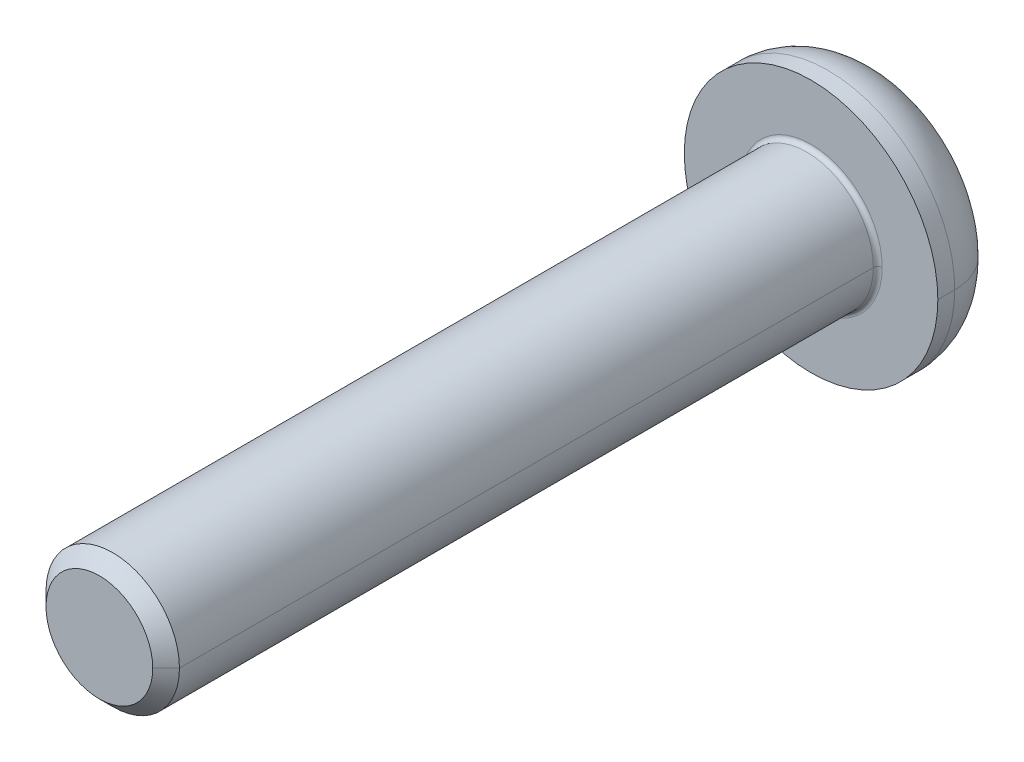
ISO-10303-21;
HEADER;
FILE_DESCRIPTION(('STEP AP214'),'2;1');
FILE_NAME('part.step','',(''),(''),'','','');
FILE_SCHEMA(('AUTOMOTIVE_DESIGN { 1 0 10303 214 1 1 1 1 }'));
ENDSEC;
DATA;
#1=APPLICATION_CONTEXT('core data for automotive mechanical design processes');
#2=APPLICATION_PROTOCOL_DEFINITION('international standard','automotive_design',2000,#1);
#3=PRODUCT_CONTEXT('',#1,'mechanical');
#4=PRODUCT('Part','Part','',(#3));
#5=PRODUCT_RELATED_PRODUCT_CATEGORY('part','',(#4));
#6=PRODUCT_DEFINITION_FORMATION('','',#4);
#7=PRODUCT_DEFINITION_CONTEXT('part definition',#1,'design');
#8=PRODUCT_DEFINITION('design','',#6,#7);
#9=PRODUCT_DEFINITION_SHAPE('','',#8);
#10=(LENGTH_UNIT() NAMED_UNIT(*) SI_UNIT(.MILLI.,.METRE.));
#11=(NAMED_UNIT(*) PLANE_ANGLE_UNIT() SI_UNIT($,.RADIAN.));
#12=(NAMED_UNIT(*) SI_UNIT($,.STERADIAN.) SOLID_ANGLE_UNIT());
#13=UNCERTAINTY_MEASURE_WITH_UNIT(LENGTH_MEASURE(1.E-05),#10,'distance_accuracy_value','');
#14=(GEOMETRIC_REPRESENTATION_CONTEXT(3) GLOBAL_UNCERTAINTY_ASSIGNED_CONTEXT((#13)) GLOBAL_UNIT_ASSIGNED_CONTEXT((#10,
#11,#12)) REPRESENTATION_CONTEXT('',''));
#15=CARTESIAN_POINT('',(0.,0.,0.));
#16=DIRECTION('',(0.,0.,1.));
#17=DIRECTION('',(1.,0.,0.));
#18=AXIS2_PLACEMENT_3D('',#15,#16,#17);
#19=CARTESIAN_POINT('',(0.,0.,0.1));
#20=DIRECTION('',(0.,0.,-1.));
#21=DIRECTION('',(-1.,0.,0.));
#22=AXIS2_PLACEMENT_3D('',#19,#20,#21);
#23=TOROIDAL_SURFACE('',#22,1.6,0.1);
#24=CARTESIAN_POINT('',(1.6,0.,0.1));
#25=DIRECTION('',(0.,1.,0.));
#26=DIRECTION('',(-1.,0.,0.));
#27=AXIS2_PLACEMENT_3D('',#24,#25,#26);
#28=CIRCLE('',#27,0.1);
#29=CARTESIAN_POINT('',(1.6,0.,0.));
#30=VERTEX_POINT('',#29);
#31=CARTESIAN_POINT('',(1.5,0.,0.1));
#32=VERTEX_POINT('',#31);
#33=EDGE_CURVE('E301',#30,#32,#28,.T.);
#34=ORIENTED_EDGE('',*,*,#33,.F.);
#35=CARTESIAN_POINT('',(0.,0.,0.));
#36=DIRECTION('',(0.,0.,-1.));
#37=DIRECTION('',(-1.,0.,0.));
#38=AXIS2_PLACEMENT_3D('',#35,#36,#37);
#39=CIRCLE('',#38,1.6);
#40=CARTESIAN_POINT('',(-1.6,0.,0.));
#41=VERTEX_POINT('',#40);
#42=EDGE_CURVE('E167',#41,#30,#39,.T.);
#43=ORIENTED_EDGE('',*,*,#42,.F.);
#44=CARTESIAN_POINT('',(-1.6,0.,0.1));
#45=DIRECTION('',(0.,-1.,0.));
#46=DIRECTION('',(0.,0.,-1.));
#47=AXIS2_PLACEMENT_3D('',#44,#45,#46);
#48=CIRCLE('',#47,0.1);
#49=CARTESIAN_POINT('',(-1.5,0.,0.1));
#50=VERTEX_POINT('',#49);
#51=EDGE_CURVE('E173',#41,#50,#48,.T.);
#52=ORIENTED_EDGE('',*,*,#51,.T.);
#53=CARTESIAN_POINT('',(0.,0.,0.1));
#54=DIRECTION('',(0.,0.,1.));
#55=DIRECTION('',(-1.,0.,0.));
#56=AXIS2_PLACEMENT_3D('',#53,#54,#55);
#57=CIRCLE('',#56,1.5);
#58=EDGE_CURVE('E221',#32,#50,#57,.T.);
#59=ORIENTED_EDGE('',*,*,#58,.F.);
#60=EDGE_LOOP('',(#34,#43,#52,#59));
#61=FACE_BOUND('',#60,.T.);
#62=ADVANCED_FACE('F17',(#61),#23,.F.);
#63=CARTESIAN_POINT('',(0.,0.,-0.38));
#64=DIRECTION('',(0.,0.,-1.));
#65=DIRECTION('',(-1.,0.,0.));
#66=AXIS2_PLACEMENT_3D('',#63,#64,#65);
#67=TOROIDAL_SURFACE('',#66,1.58,1.27);
#68=CARTESIAN_POINT('',(1.58,0.,-0.38));
#69=DIRECTION('',(0.,1.,0.));
#70=DIRECTION('',(-1.,0.,0.));
#71=AXIS2_PLACEMENT_3D('',#68,#69,#70);
#72=CIRCLE('',#71,1.27);
#73=CARTESIAN_POINT('',(2.85,0.,-0.38));
#74=VERTEX_POINT('',#73);
#75=CARTESIAN_POINT('',(1.58,0.,-1.65));
#76=VERTEX_POINT('',#75);
#77=EDGE_CURVE('E188',#74,#76,#72,.T.);
#78=ORIENTED_EDGE('',*,*,#77,.F.);
#79=CARTESIAN_POINT('',(0.,0.,-0.38));
#80=DIRECTION('',(0.,0.,1.));
#81=DIRECTION('',(-1.,0.,0.));
#82=AXIS2_PLACEMENT_3D('',#79,#80,#81);
#83=CIRCLE('',#82,2.85);
#84=CARTESIAN_POINT('',(-2.85,0.,-0.38));
#85=VERTEX_POINT('',#84);
#86=EDGE_CURVE('E203',#85,#74,#83,.T.);
#87=ORIENTED_EDGE('',*,*,#86,.F.);
#88=CARTESIAN_POINT('',(-1.58,0.,-0.38));
#89=DIRECTION('',(0.,-1.,0.));
#90=DIRECTION('',(0.,0.,-1.));
#91=AXIS2_PLACEMENT_3D('',#88,#89,#90);
#92=CIRCLE('',#91,1.27);
#93=CARTESIAN_POINT('',(-1.58,0.,-1.65));
#94=VERTEX_POINT('',#93);
#95=EDGE_CURVE('E198',#85,#94,#92,.T.);
#96=ORIENTED_EDGE('',*,*,#95,.T.);
#97=CARTESIAN_POINT('',(0.,0.,-1.65));
#98=DIRECTION('',(0.,0.,-1.));
#99=DIRECTION('',(-1.,0.,0.));
#100=AXIS2_PLACEMENT_3D('',#97,#98,#99);
#101=CIRCLE('',#100,1.58);
#102=EDGE_CURVE('E202',#76,#94,#101,.T.);
#103=ORIENTED_EDGE('',*,*,#102,.F.);
#104=EDGE_LOOP('',(#78,#87,#96,#103));
#105=FACE_BOUND('',#104,.T.);
#106=ADVANCED_FACE('F477',(#105),#67,.T.);
#107=CARTESIAN_POINT('',(0.,0.,-0.61));
#108=DIRECTION('',(0.,0.,-1.));
#109=DIRECTION('',(0.,-1.,0.));
#110=AXIS2_PLACEMENT_3D('',#107,#108,#109);
#111=PLANE('',#110);
#112=DIRECTION('',(-1.,0.,0.));
#113=VECTOR('',#112,1.);
#114=CARTESIAN_POINT('',(0.577350269189626,-1.,-0.61));
#115=LINE('',#114,#113);
#116=CARTESIAN_POINT('',(0.577350269189626,-1.,-0.61));
#117=VERTEX_POINT('',#116);
#118=CARTESIAN_POINT('',(-0.577350269189626,-1.,-0.61));
#119=VERTEX_POINT('',#118);
#120=EDGE_CURVE('E140',#117,#119,#115,.T.);
#121=ORIENTED_EDGE('',*,*,#120,.T.);
#122=DIRECTION('',(-0.5,0.866025403784439,0.));
#123=VECTOR('',#122,1.);
#124=CARTESIAN_POINT('',(-0.577350269189626,-1.,-0.61));
#125=LINE('',#124,#123);
#126=CARTESIAN_POINT('',(-1.15470053837925,0.,-0.61));
#127=VERTEX_POINT('',#126);
#128=EDGE_CURVE('E11',#119,#127,#125,.T.);
#129=ORIENTED_EDGE('',*,*,#128,.T.);
#130=DIRECTION('',(0.5,0.866025403784439,0.));
#131=VECTOR('',#130,1.);
#132=CARTESIAN_POINT('',(-1.15470053837925,0.,-0.61));
#133=LINE('',#132,#131);
#134=CARTESIAN_POINT('',(-0.577350269189626,1.,-0.61));
#135=VERTEX_POINT('',#134);
#136=EDGE_CURVE('E272',#127,#135,#133,.T.);
#137=ORIENTED_EDGE('',*,*,#136,.T.);
#138=DIRECTION('',(1.,0.,0.));
#139=VECTOR('',#138,1.);
#140=CARTESIAN_POINT('',(-0.577350269189626,1.,-0.61));
#141=LINE('',#140,#139);
#142=CARTESIAN_POINT('',(0.577350269189626,1.,-0.61));
#143=VERTEX_POINT('',#142);
#144=EDGE_CURVE('E268',#135,#143,#141,.T.);
#145=ORIENTED_EDGE('',*,*,#144,.T.);
#146=DIRECTION('',(0.5,-0.866025403784439,0.));
#147=VECTOR('',#146,1.);
#148=CARTESIAN_POINT('',(0.577350269189626,1.,-0.61));
#149=LINE('',#148,#147);
#150=CARTESIAN_POINT('',(1.15470053837925,0.,-0.61));
#151=VERTEX_POINT('',#150);
#152=EDGE_CURVE('E143',#143,#151,#149,.T.);
#153=ORIENTED_EDGE('',*,*,#152,.T.);
#154=DIRECTION('',(-0.5,-0.866025403784439,0.));
#155=VECTOR('',#154,1.);
#156=CARTESIAN_POINT('',(1.15470053837925,0.,-0.61));
#157=LINE('',#156,#155);
#158=EDGE_CURVE('E136',#151,#117,#157,.T.);
#159=ORIENTED_EDGE('',*,*,#158,.T.);
#160=EDGE_LOOP('',(#121,#129,#137,#145,#153,#159));
#161=FACE_BOUND('',#160,.T.);
#162=ADVANCED_FACE('F138',(#161),#111,.T.);
#163=CARTESIAN_POINT('',(-0.577350269189626,-1.,-0.61));
#164=DIRECTION('',(-0.866025403784439,-0.5,0.));
#165=DIRECTION('',(-0.5,0.866025403784439,0.));
#166=AXIS2_PLACEMENT_3D('',#163,#164,#165);
#167=PLANE('',#166);
#168=DIRECTION('',(-0.5,0.866025403784439,0.));
#169=VECTOR('',#168,1.);
#170=CARTESIAN_POINT('',(-0.577350269189626,-1.,-1.65));
#171=LINE('',#170,#169);
#172=CARTESIAN_POINT('',(-0.577350269189626,-1.,-1.65));
#173=VERTEX_POINT('',#172);
#174=CARTESIAN_POINT('',(-1.15470053837925,0.,-1.65));
#175=VERTEX_POINT('',#174);
#176=EDGE_CURVE('E253',#173,#175,#171,.T.);
#177=ORIENTED_EDGE('',*,*,#176,.T.);
#178=DIRECTION('',(0.,0.,-1.));
#179=VECTOR('',#178,1.);
#180=CARTESIAN_POINT('',(-1.15470053837925,0.,-0.61));
#181=LINE('',#180,#179);
#182=EDGE_CURVE('E26',#127,#175,#181,.T.);
#183=ORIENTED_EDGE('',*,*,#182,.F.);
#184=ORIENTED_EDGE('',*,*,#128,.F.);
#185=DIRECTION('',(0.,0.,-1.));
#186=VECTOR('',#185,1.);
#187=CARTESIAN_POINT('',(-0.577350269189626,-1.,-0.61));
#188=LINE('',#187,#186);
#189=EDGE_CURVE('E160',#119,#173,#188,.T.);
#190=ORIENTED_EDGE('',*,*,#189,.T.);
#191=EDGE_LOOP('',(#177,#183,#184,#190));
#192=FACE_BOUND('',#191,.T.);
#193=ADVANCED_FACE('F286',(#192),#167,.F.);
#194=CARTESIAN_POINT('',(-1.15470053837925,0.,-0.61));
#195=DIRECTION('',(-0.866025403784439,0.5,0.));
#196=DIRECTION('',(0.,0.,1.));
#197=AXIS2_PLACEMENT_3D('',#194,#195,#196);
#198=PLANE('',#197);
#199=DIRECTION('',(0.5,0.866025403784439,0.));
#200=VECTOR('',#199,1.);
#201=CARTESIAN_POINT('',(-1.15470053837925,0.,-1.65));
#202=LINE('',#201,#200);
#203=CARTESIAN_POINT('',(-0.577350269189626,1.,-1.65));
#204=VERTEX_POINT('',#203);
#205=EDGE_CURVE('E249',#175,#204,#202,.T.);
#206=ORIENTED_EDGE('',*,*,#205,.T.);
#207=DIRECTION('',(0.,0.,-1.));
#208=VECTOR('',#207,1.);
#209=CARTESIAN_POINT('',(-0.577350269189626,1.,-0.61));
#210=LINE('',#209,#208);
#211=EDGE_CURVE('E269',#135,#204,#210,.T.);
#212=ORIENTED_EDGE('',*,*,#211,.F.);
#213=ORIENTED_EDGE('',*,*,#136,.F.);
#214=ORIENTED_EDGE('',*,*,#182,.T.);
#215=EDGE_LOOP('',(#206,#212,#213,#214));
#216=FACE_BOUND('',#215,.T.);
#217=ADVANCED_FACE('F281',(#216),#198,.F.);
#218=CARTESIAN_POINT('',(-0.577350269189626,1.,-0.61));
#219=DIRECTION('',(0.,1.,0.));
#220=DIRECTION('',(1.,0.,0.));
#221=AXIS2_PLACEMENT_3D('',#218,#219,#220);
#222=PLANE('',#221);
#223=DIRECTION('',(1.,0.,0.));
#224=VECTOR('',#223,1.);
#225=CARTESIAN_POINT('',(-0.577350269189626,1.,-1.65));
#226=LINE('',#225,#224);
#227=CARTESIAN_POINT('',(0.577350269189626,1.,-1.65));
#228=VERTEX_POINT('',#227);
#229=EDGE_CURVE('E254',#204,#228,#226,.T.);
#230=ORIENTED_EDGE('',*,*,#229,.T.);
#231=DIRECTION('',(0.,0.,-1.));
#232=VECTOR('',#231,1.);
#233=CARTESIAN_POINT('',(0.577350269189626,1.,-0.61));
#234=LINE('',#233,#232);
#235=EDGE_CURVE('E240',#143,#228,#234,.T.);
#236=ORIENTED_EDGE('',*,*,#235,.F.);
#237=ORIENTED_EDGE('',*,*,#144,.F.);
#238=ORIENTED_EDGE('',*,*,#211,.T.);
#239=EDGE_LOOP('',(#230,#236,#237,#238));
#240=FACE_BOUND('',#239,.T.);
#241=ADVANCED_FACE('F532',(#240),#222,.F.);
#242=CARTESIAN_POINT('',(0.577350269189626,1.,-0.61));
#243=DIRECTION('',(0.866025403784439,0.5,0.));
#244=DIRECTION('',(0.,0.,-1.));
#245=AXIS2_PLACEMENT_3D('',#242,#243,#244);
#246=PLANE('',#245);
#247=DIRECTION('',(0.5,-0.866025403784439,0.));
#248=VECTOR('',#247,1.);
#249=CARTESIAN_POINT('',(0.577350269189626,1.,-1.65));
#250=LINE('',#249,#248);
#251=CARTESIAN_POINT('',(1.15470053837925,0.,-1.65));
#252=VERTEX_POINT('',#251);
#253=EDGE_CURVE('E248',#228,#252,#250,.T.);
#254=ORIENTED_EDGE('',*,*,#253,.T.);
#255=DIRECTION('',(0.,0.,-1.));
#256=VECTOR('',#255,1.);
#257=CARTESIAN_POINT('',(1.15470053837925,0.,-0.61));
#258=LINE('',#257,#256);
#259=EDGE_CURVE('E147',#151,#252,#258,.T.);
#260=ORIENTED_EDGE('',*,*,#259,.F.);
#261=ORIENTED_EDGE('',*,*,#152,.F.);
#262=ORIENTED_EDGE('',*,*,#235,.T.);
#263=EDGE_LOOP('',(#254,#260,#261,#262));
#264=FACE_BOUND('',#263,.T.);
#265=ADVANCED_FACE('F529',(#264),#246,.F.);
#266=CARTESIAN_POINT('',(1.15470053837925,0.,-0.61));
#267=DIRECTION('',(0.866025403784439,-0.5,0.));
#268=DIRECTION('',(0.,0.,-1.));
#269=AXIS2_PLACEMENT_3D('',#266,#267,#268);
#270=PLANE('',#269);
#271=DIRECTION('',(-0.5,-0.866025403784439,0.));
#272=VECTOR('',#271,1.);
#273=CARTESIAN_POINT('',(1.15470053837925,0.,-1.65));
#274=LINE('',#273,#272);
#275=CARTESIAN_POINT('',(0.577350269189626,-1.,-1.65));
#276=VERTEX_POINT('',#275);
#277=EDGE_CURVE('E153',#252,#276,#274,.T.);
#278=ORIENTED_EDGE('',*,*,#277,.T.);
#279=DIRECTION('',(0.,0.,-1.));
#280=VECTOR('',#279,1.);
#281=CARTESIAN_POINT('',(0.577350269189626,-1.,-0.61));
#282=LINE('',#281,#280);
#283=EDGE_CURVE('E148',#117,#276,#282,.T.);
#284=ORIENTED_EDGE('',*,*,#283,.F.);
#285=ORIENTED_EDGE('',*,*,#158,.F.);
#286=ORIENTED_EDGE('',*,*,#259,.T.);
#287=EDGE_LOOP('',(#278,#284,#285,#286));
#288=FACE_BOUND('',#287,.T.);
#289=ADVANCED_FACE('F151',(#288),#270,.F.);
#290=CARTESIAN_POINT('',(0.577350269189626,-1.,-0.61));
#291=DIRECTION('',(0.,-1.,0.));
#292=DIRECTION('',(-1.,0.,0.));
#293=AXIS2_PLACEMENT_3D('',#290,#291,#292);
#294=PLANE('',#293);
#295=DIRECTION('',(-1.,0.,0.));
#296=VECTOR('',#295,1.);
#297=CARTESIAN_POINT('',(0.577350269189626,-1.,-1.65));
#298=LINE('',#297,#296);
#299=EDGE_CURVE('E243',#276,#173,#298,.T.);
#300=ORIENTED_EDGE('',*,*,#299,.T.);
#301=ORIENTED_EDGE('',*,*,#189,.F.);
#302=ORIENTED_EDGE('',*,*,#120,.F.);
#303=ORIENTED_EDGE('',*,*,#283,.T.);
#304=EDGE_LOOP('',(#300,#301,#302,#303));
#305=FACE_BOUND('',#304,.T.);
#306=ADVANCED_FACE('F159',(#305),#294,.F.);
#307=CARTESIAN_POINT('',(0.,0.,0.));
#308=DIRECTION('',(0.,0.,-1.));
#309=DIRECTION('',(0.,-1.,0.));
#310=AXIS2_PLACEMENT_3D('',#307,#308,#309);
#311=PLANE('',#310);
#312=ORIENTED_EDGE('',*,*,#42,.T.);
#313=CARTESIAN_POINT('',(0.,0.,0.));
#314=DIRECTION('',(0.,0.,-1.));
#315=DIRECTION('',(-1.,0.,0.));
#316=AXIS2_PLACEMENT_3D('',#313,#314,#315);
#317=CIRCLE('',#316,1.6);
#318=EDGE_CURVE('E310',#30,#41,#317,.T.);
#319=ORIENTED_EDGE('',*,*,#318,.T.);
#320=EDGE_LOOP('',(#312,#319));
#321=FACE_BOUND('',#320,.T.);
#322=CARTESIAN_POINT('',(0.,0.,0.));
#323=DIRECTION('',(0.,0.,-1.));
#324=DIRECTION('',(-1.,0.,0.));
#325=AXIS2_PLACEMENT_3D('',#322,#323,#324);
#326=CIRCLE('',#325,2.85);
#327=CARTESIAN_POINT('',(2.85,0.,0.));
#328=VERTEX_POINT('',#327);
#329=CARTESIAN_POINT('',(-2.85,0.,0.));
#330=VERTEX_POINT('',#329);
#331=EDGE_CURVE('E199',#328,#330,#326,.T.);
#332=ORIENTED_EDGE('',*,*,#331,.F.);
#333=CARTESIAN_POINT('',(0.,0.,0.));
#334=DIRECTION('',(0.,0.,-1.));
#335=DIRECTION('',(-1.,0.,0.));
#336=AXIS2_PLACEMENT_3D('',#333,#334,#335);
#337=CIRCLE('',#336,2.85);
#338=EDGE_CURVE('E207',#330,#328,#337,.T.);
#339=ORIENTED_EDGE('',*,*,#338,.F.);
#340=EDGE_LOOP('',(#332,#339));
#341=FACE_BOUND('',#340,.T.);
#342=ADVANCED_FACE('F317',(#321,#341),#311,.F.);
#343=CARTESIAN_POINT('',(0.,0.,-1.65));
#344=DIRECTION('',(0.,0.,-1.));
#345=DIRECTION('',(0.,-1.,0.));
#346=AXIS2_PLACEMENT_3D('',#343,#344,#345);
#347=PLANE('',#346);
#348=ORIENTED_EDGE('',*,*,#299,.F.);
#349=ORIENTED_EDGE('',*,*,#277,.F.);
#350=ORIENTED_EDGE('',*,*,#253,.F.);
#351=ORIENTED_EDGE('',*,*,#229,.F.);
#352=ORIENTED_EDGE('',*,*,#205,.F.);
#353=ORIENTED_EDGE('',*,*,#176,.F.);
#354=EDGE_LOOP('',(#348,#349,#350,#351,#352,#353));
#355=FACE_BOUND('',#354,.T.);
#356=CARTESIAN_POINT('',(0.,0.,-1.65));
#357=DIRECTION('',(0.,0.,-1.));
#358=DIRECTION('',(-1.,0.,0.));
#359=AXIS2_PLACEMENT_3D('',#356,#357,#358);
#360=CIRCLE('',#359,1.58);
#361=EDGE_CURVE('E194',#94,#76,#360,.T.);
#362=ORIENTED_EDGE('',*,*,#361,.T.);
#363=ORIENTED_EDGE('',*,*,#102,.T.);
#364=EDGE_LOOP('',(#362,#363));
#365=FACE_BOUND('',#364,.T.);
#366=ADVANCED_FACE('F288',(#355,#365),#347,.T.);
#367=CARTESIAN_POINT('',(0.,0.,-1.65));
#368=DIRECTION('',(0.,0.,1.));
#369=DIRECTION('',(1.,0.,0.));
#370=AXIS2_PLACEMENT_3D('',#367,#368,#369);
#371=CYLINDRICAL_SURFACE('',#370,2.85);
#372=DIRECTION('',(0.,0.,1.));
#373=VECTOR('',#372,1.);
#374=CARTESIAN_POINT('',(-2.85,0.,-1.65));
#375=LINE('',#374,#373);
#376=EDGE_CURVE('E208',#85,#330,#375,.T.);
#377=ORIENTED_EDGE('',*,*,#376,.F.);
#378=ORIENTED_EDGE('',*,*,#86,.T.);
#379=DIRECTION('',(0.,0.,1.));
#380=VECTOR('',#379,1.);
#381=CARTESIAN_POINT('',(2.85,0.,-1.65));
#382=LINE('',#381,#380);
#383=EDGE_CURVE('E184',#74,#328,#382,.T.);
#384=ORIENTED_EDGE('',*,*,#383,.T.);
#385=ORIENTED_EDGE('',*,*,#331,.T.);
#386=EDGE_LOOP('',(#377,#378,#384,#385));
#387=FACE_BOUND('',#386,.T.);
#388=ADVANCED_FACE('F469',(#387),#371,.T.);
#389=CARTESIAN_POINT('',(0.,0.,16.));
#390=DIRECTION('',(0.,0.,-1.));
#391=DIRECTION('',(-1.,0.,0.));
#392=AXIS2_PLACEMENT_3D('',#389,#390,#391);
#393=CONICAL_SURFACE('',#392,1.2,0.785398163397449);
#394=DIRECTION('',(0.707106781186548,0.,-0.707106781186547));
#395=VECTOR('',#394,1.);
#396=CARTESIAN_POINT('',(1.2,0.,16.));
#397=LINE('',#396,#395);
#398=CARTESIAN_POINT('',(1.2,0.,16.));
#399=VERTEX_POINT('',#398);
#400=CARTESIAN_POINT('',(1.5,0.,15.7));
#401=VERTEX_POINT('',#400);
#402=EDGE_CURVE('E183',#399,#401,#397,.T.);
#403=ORIENTED_EDGE('',*,*,#402,.F.);
#404=CARTESIAN_POINT('',(0.,0.,16.));
#405=DIRECTION('',(0.,0.,1.));
#406=DIRECTION('',(1.,0.,0.));
#407=AXIS2_PLACEMENT_3D('',#404,#405,#406);
#408=CIRCLE('',#407,1.2);
#409=CARTESIAN_POINT('',(-1.2,0.,16.));
#410=VERTEX_POINT('',#409);
#411=EDGE_CURVE('E234',#410,#399,#408,.T.);
#412=ORIENTED_EDGE('',*,*,#411,.F.);
#413=DIRECTION('',(-0.707106781186548,0.,-0.707106781186547));
#414=VECTOR('',#413,1.);
#415=CARTESIAN_POINT('',(-1.2,0.,16.));
#416=LINE('',#415,#414);
#417=CARTESIAN_POINT('',(-1.5,0.,15.7));
#418=VERTEX_POINT('',#417);
#419=EDGE_CURVE('E189',#410,#418,#416,.T.);
#420=ORIENTED_EDGE('',*,*,#419,.T.);
#421=CARTESIAN_POINT('',(0.,0.,15.7));
#422=DIRECTION('',(0.,0.,-1.));
#423=DIRECTION('',(1.,0.,0.));
#424=AXIS2_PLACEMENT_3D('',#421,#422,#423);
#425=CIRCLE('',#424,1.5);
#426=EDGE_CURVE('E231',#401,#418,#425,.T.);
#427=ORIENTED_EDGE('',*,*,#426,.F.);
#428=EDGE_LOOP('',(#403,#412,#420,#427));
#429=FACE_BOUND('',#428,.T.);
#430=ADVANCED_FACE('F488',(#429),#393,.T.);
#431=CARTESIAN_POINT('',(0.,0.,16.));
#432=DIRECTION('',(0.,0.,1.));
#433=DIRECTION('',(1.,0.,0.));
#434=AXIS2_PLACEMENT_3D('',#431,#432,#433);
#435=PLANE('',#434);
#436=ORIENTED_EDGE('',*,*,#411,.T.);
#437=CARTESIAN_POINT('',(0.,0.,16.));
#438=DIRECTION('',(0.,0.,1.));
#439=DIRECTION('',(1.,0.,0.));
#440=AXIS2_PLACEMENT_3D('',#437,#438,#439);
#441=CIRCLE('',#440,1.2);
#442=EDGE_CURVE('E179',#399,#410,#441,.T.);
#443=ORIENTED_EDGE('',*,*,#442,.T.);
#444=EDGE_LOOP('',(#436,#443));
#445=FACE_BOUND('',#444,.T.);
#446=ADVANCED_FACE('F514',(#445),#435,.T.);
#447=CARTESIAN_POINT('',(0.,0.,16.));
#448=DIRECTION('',(0.,0.,-1.));
#449=DIRECTION('',(-1.,0.,0.));
#450=AXIS2_PLACEMENT_3D('',#447,#448,#449);
#451=CYLINDRICAL_SURFACE('',#450,1.5);
#452=DIRECTION('',(0.,0.,-1.));
#453=VECTOR('',#452,1.);
#454=CARTESIAN_POINT('',(1.5,0.,16.));
#455=LINE('',#454,#453);
#456=EDGE_CURVE('E171',#401,#32,#455,.T.);
#457=ORIENTED_EDGE('',*,*,#456,.F.);
#458=ORIENTED_EDGE('',*,*,#426,.T.);
#459=DIRECTION('',(0.,0.,-1.));
#460=VECTOR('',#459,1.);
#461=CARTESIAN_POINT('',(-1.5,0.,16.));
#462=LINE('',#461,#460);
#463=EDGE_CURVE('E225',#418,#50,#462,.T.);
#464=ORIENTED_EDGE('',*,*,#463,.T.);
#465=CARTESIAN_POINT('',(0.,0.,0.1));
#466=DIRECTION('',(0.,0.,1.));
#467=DIRECTION('',(-1.,0.,0.));
#468=AXIS2_PLACEMENT_3D('',#465,#466,#467);
#469=CIRCLE('',#468,1.5);
#470=EDGE_CURVE('E178',#50,#32,#469,.T.);
#471=ORIENTED_EDGE('',*,*,#470,.T.);
#472=EDGE_LOOP('',(#457,#458,#464,#471));
#473=FACE_BOUND('',#472,.T.);
#474=ADVANCED_FACE('F506',(#473),#451,.T.);
#475=CARTESIAN_POINT('',(0.,0.,16.));
#476=DIRECTION('',(0.,0.,-1.));
#477=DIRECTION('',(-1.,0.,0.));
#478=AXIS2_PLACEMENT_3D('',#475,#476,#477);
#479=CYLINDRICAL_SURFACE('',#478,1.5);
#480=CARTESIAN_POINT('',(0.,0.,15.7));
#481=DIRECTION('',(0.,0.,-1.));
#482=DIRECTION('',(1.,0.,0.));
#483=AXIS2_PLACEMENT_3D('',#480,#481,#482);
#484=CIRCLE('',#483,1.5);
#485=EDGE_CURVE('E193',#418,#401,#484,.T.);
#486=ORIENTED_EDGE('',*,*,#485,.T.);
#487=ORIENTED_EDGE('',*,*,#456,.T.);
#488=ORIENTED_EDGE('',*,*,#58,.T.);
#489=ORIENTED_EDGE('',*,*,#463,.F.);
#490=EDGE_LOOP('',(#486,#487,#488,#489));
#491=FACE_BOUND('',#490,.T.);
#492=ADVANCED_FACE('F502',(#491),#479,.T.);
#493=CARTESIAN_POINT('',(0.,0.,16.));
#494=DIRECTION('',(0.,0.,-1.));
#495=DIRECTION('',(-1.,0.,0.));
#496=AXIS2_PLACEMENT_3D('',#493,#494,#495);
#497=CONICAL_SURFACE('',#496,1.2,0.785398163397449);
#498=ORIENTED_EDGE('',*,*,#442,.F.);
#499=ORIENTED_EDGE('',*,*,#402,.T.);
#500=ORIENTED_EDGE('',*,*,#485,.F.);
#501=ORIENTED_EDGE('',*,*,#419,.F.);
#502=EDGE_LOOP('',(#498,#499,#500,#501));
#503=FACE_BOUND('',#502,.T.);
#504=ADVANCED_FACE('F512',(#503),#497,.T.);
#505=CARTESIAN_POINT('',(0.,0.,-1.65));
#506=DIRECTION('',(0.,0.,1.));
#507=DIRECTION('',(1.,0.,0.));
#508=AXIS2_PLACEMENT_3D('',#505,#506,#507);
#509=CYLINDRICAL_SURFACE('',#508,2.85);
#510=CARTESIAN_POINT('',(0.,0.,-0.38));
#511=DIRECTION('',(0.,0.,1.));
#512=DIRECTION('',(-1.,0.,0.));
#513=AXIS2_PLACEMENT_3D('',#510,#511,#512);
#514=CIRCLE('',#513,2.85);
#515=EDGE_CURVE('E177',#74,#85,#514,.T.);
#516=ORIENTED_EDGE('',*,*,#515,.T.);
#517=ORIENTED_EDGE('',*,*,#376,.T.);
#518=ORIENTED_EDGE('',*,*,#338,.T.);
#519=ORIENTED_EDGE('',*,*,#383,.F.);
#520=EDGE_LOOP('',(#516,#517,#518,#519));
#521=FACE_BOUND('',#520,.T.);
#522=ADVANCED_FACE('F474',(#521),#509,.T.);
#523=CARTESIAN_POINT('',(0.,0.,-0.38));
#524=DIRECTION('',(0.,0.,-1.));
#525=DIRECTION('',(-1.,0.,0.));
#526=AXIS2_PLACEMENT_3D('',#523,#524,#525);
#527=TOROIDAL_SURFACE('',#526,1.58,1.27);
#528=ORIENTED_EDGE('',*,*,#515,.F.);
#529=ORIENTED_EDGE('',*,*,#77,.T.);
#530=ORIENTED_EDGE('',*,*,#361,.F.);
#531=ORIENTED_EDGE('',*,*,#95,.F.);
#532=EDGE_LOOP('',(#528,#529,#530,#531));
#533=FACE_BOUND('',#532,.T.);
#534=ADVANCED_FACE('F480',(#533),#527,.T.);
#535=CARTESIAN_POINT('',(0.,0.,0.1));
#536=DIRECTION('',(0.,0.,-1.));
#537=DIRECTION('',(-1.,0.,0.));
#538=AXIS2_PLACEMENT_3D('',#535,#536,#537);
#539=TOROIDAL_SURFACE('',#538,1.6,0.1);
#540=ORIENTED_EDGE('',*,*,#318,.F.);
#541=ORIENTED_EDGE('',*,*,#33,.T.);
#542=ORIENTED_EDGE('',*,*,#470,.F.);
#543=ORIENTED_EDGE('',*,*,#51,.F.);
#544=EDGE_LOOP('',(#540,#541,#542,#543));
#545=FACE_BOUND('',#544,.T.);
#546=ADVANCED_FACE('F322',(#545),#539,.F.);
#547=CLOSED_SHELL('',(#62,#106,#162,#193,#217,#241,#265,#289,#306,#342,#366,#388,#430,#446,#474,
#492,#504,#522,#534,#546));
#548=MANIFOLD_SOLID_BREP('B1',#547);
#549=ADVANCED_BREP_SHAPE_REPRESENTATION('',(#18,#548),#14);
#550=SHAPE_DEFINITION_REPRESENTATION(#9,#549);
ENDSEC;
END-ISO-10303-21;
